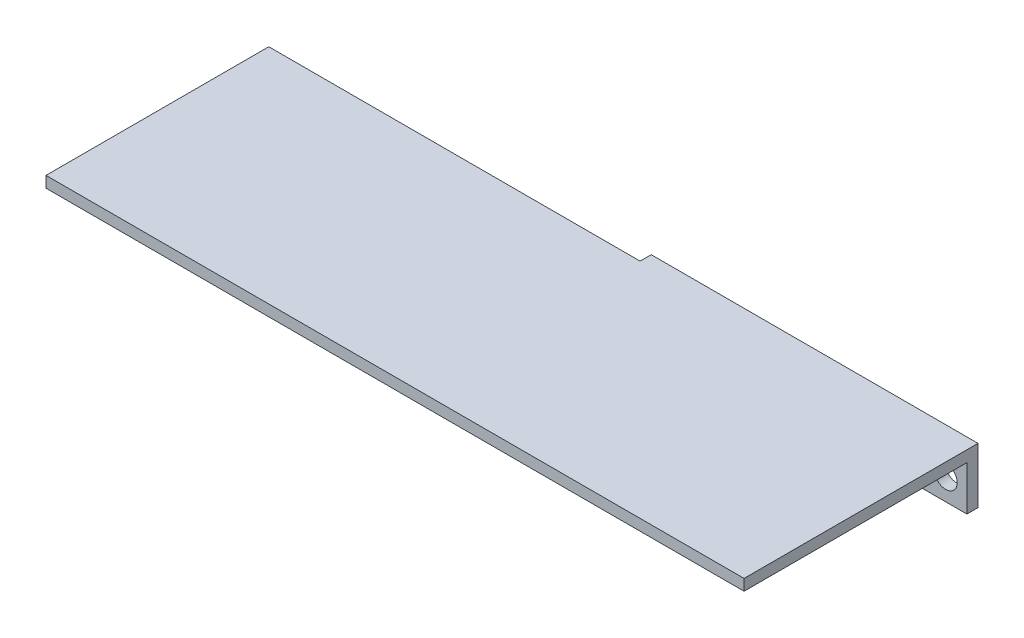
ISO-10303-21;
HEADER;
FILE_DESCRIPTION(('STEP AP214'),'2;1');
FILE_NAME('part.step','',(''),(''),'','','');
FILE_SCHEMA(('AUTOMOTIVE_DESIGN { 1 0 10303 214 1 1 1 1 }'));
ENDSEC;
DATA;
#1=APPLICATION_CONTEXT('core data for automotive mechanical design processes');
#2=APPLICATION_PROTOCOL_DEFINITION('international standard','automotive_design',2000,#1);
#3=PRODUCT_CONTEXT('',#1,'mechanical');
#4=PRODUCT('Part','Part','',(#3));
#5=PRODUCT_RELATED_PRODUCT_CATEGORY('part','',(#4));
#6=PRODUCT_DEFINITION_FORMATION('','',#4);
#7=PRODUCT_DEFINITION_CONTEXT('part definition',#1,'design');
#8=PRODUCT_DEFINITION('design','',#6,#7);
#9=PRODUCT_DEFINITION_SHAPE('','',#8);
#10=(LENGTH_UNIT() NAMED_UNIT(*) SI_UNIT(.MILLI.,.METRE.));
#11=(NAMED_UNIT(*) PLANE_ANGLE_UNIT() SI_UNIT($,.RADIAN.));
#12=(NAMED_UNIT(*) SI_UNIT($,.STERADIAN.) SOLID_ANGLE_UNIT());
#13=UNCERTAINTY_MEASURE_WITH_UNIT(LENGTH_MEASURE(1.E-05),#10,'distance_accuracy_value','');
#14=(GEOMETRIC_REPRESENTATION_CONTEXT(3) GLOBAL_UNCERTAINTY_ASSIGNED_CONTEXT((#13)) GLOBAL_UNIT_ASSIGNED_CONTEXT((#10,
#11,#12)) REPRESENTATION_CONTEXT('',''));
#15=CARTESIAN_POINT('',(0.,0.,0.));
#16=DIRECTION('',(0.,0.,1.));
#17=DIRECTION('',(1.,0.,0.));
#18=AXIS2_PLACEMENT_3D('',#15,#16,#17);
#19=CARTESIAN_POINT('',(-22.,-2.99999999999999,1.5));
#20=DIRECTION('',(1.,0.,0.));
#21=DIRECTION('',(0.,0.,-1.));
#22=AXIS2_PLACEMENT_3D('',#19,#20,#21);
#23=PLANE('',#22);
#24=DIRECTION('',(0.,-1.,0.));
#25=VECTOR('',#24,1.);
#26=CARTESIAN_POINT('',(-22.,4.5,1.5));
#27=LINE('',#26,#25);
#28=CARTESIAN_POINT('',(-22.,4.5,1.5));
#29=VERTEX_POINT('',#28);
#30=CARTESIAN_POINT('',(-22.,3.,1.5));
#31=VERTEX_POINT('',#30);
#32=EDGE_CURVE('E48',#29,#31,#27,.T.);
#33=ORIENTED_EDGE('',*,*,#32,.F.);
#34=DIRECTION('',(0.,0.,1.));
#35=VECTOR('',#34,1.);
#36=CARTESIAN_POINT('',(-22.,4.5,0.));
#37=LINE('',#36,#35);
#38=CARTESIAN_POINT('',(-22.,4.5,0.));
#39=VERTEX_POINT('',#38);
#40=EDGE_CURVE('E115',#39,#29,#37,.T.);
#41=ORIENTED_EDGE('',*,*,#40,.F.);
#42=DIRECTION('',(0.,-1.,0.));
#43=VECTOR('',#42,1.);
#44=CARTESIAN_POINT('',(-22.,-2.99999999999999,0.));
#45=LINE('',#44,#43);
#46=CARTESIAN_POINT('',(-22.,-2.99999999999999,0.));
#47=VERTEX_POINT('',#46);
#48=EDGE_CURVE('E78',#39,#47,#45,.T.);
#49=ORIENTED_EDGE('',*,*,#48,.T.);
#50=DIRECTION('',(0.,0.,-1.));
#51=VECTOR('',#50,1.);
#52=CARTESIAN_POINT('',(-22.,-2.99999999999999,1.5));
#53=LINE('',#52,#51);
#54=CARTESIAN_POINT('',(-22.,-2.99999999999999,1.5));
#55=VERTEX_POINT('',#54);
#56=EDGE_CURVE('E11',#55,#47,#53,.T.);
#57=ORIENTED_EDGE('',*,*,#56,.F.);
#58=DIRECTION('',(0.,-1.,0.));
#59=VECTOR('',#58,1.);
#60=CARTESIAN_POINT('',(-22.,-2.99999999999999,1.5));
#61=LINE('',#60,#59);
#62=EDGE_CURVE('E93',#31,#55,#61,.T.);
#63=ORIENTED_EDGE('',*,*,#62,.F.);
#64=EDGE_LOOP('',(#33,#41,#49,#57,#63));
#65=FACE_BOUND('',#64,.T.);
#66=ADVANCED_FACE('F34',(#65),#23,.F.);
#67=CARTESIAN_POINT('',(0.,0.,1.5));
#68=DIRECTION('',(0.,0.,1.));
#69=DIRECTION('',(1.,0.,0.));
#70=AXIS2_PLACEMENT_3D('',#67,#68,#69);
#71=PLANE('',#70);
#72=DIRECTION('',(1.,0.,0.));
#73=VECTOR('',#72,1.);
#74=CARTESIAN_POINT('',(0.,3.,1.5));
#75=LINE('',#74,#73);
#76=CARTESIAN_POINT('',(22.,3.,1.5));
#77=VERTEX_POINT('',#76);
#78=EDGE_CURVE('E117',#31,#77,#75,.T.);
#79=ORIENTED_EDGE('',*,*,#78,.F.);
#80=ORIENTED_EDGE('',*,*,#62,.T.);
#81=DIRECTION('',(1.,0.,0.));
#82=VECTOR('',#81,1.);
#83=CARTESIAN_POINT('',(22.,-3.,1.5));
#84=LINE('',#83,#82);
#85=CARTESIAN_POINT('',(22.,-3.,1.5));
#86=VERTEX_POINT('',#85);
#87=EDGE_CURVE('E57',#55,#86,#84,.T.);
#88=ORIENTED_EDGE('',*,*,#87,.T.);
#89=DIRECTION('',(0.,1.,0.));
#90=VECTOR('',#89,1.);
#91=CARTESIAN_POINT('',(22.,-3.,1.5));
#92=LINE('',#91,#90);
#93=EDGE_CURVE('E87',#86,#77,#92,.T.);
#94=ORIENTED_EDGE('',*,*,#93,.T.);
#95=EDGE_LOOP('',(#79,#80,#88,#94));
#96=FACE_BOUND('',#95,.T.);
#97=CARTESIAN_POINT('',(-19.14418972,0.,1.5));
#98=DIRECTION('',(0.,0.,1.));
#99=DIRECTION('',(1.,0.,0.));
#100=AXIS2_PLACEMENT_3D('',#97,#98,#99);
#101=CIRCLE('',#100,1.55);
#102=CARTESIAN_POINT('',(-17.59418972,0.,1.5));
#103=VERTEX_POINT('',#102);
#104=EDGE_CURVE('E98',#103,#103,#101,.T.);
#105=ORIENTED_EDGE('',*,*,#104,.F.);
#106=EDGE_LOOP('',(#105));
#107=FACE_BOUND('',#106,.T.);
#108=CARTESIAN_POINT('',(19.14418972,0.,1.5));
#109=DIRECTION('',(0.,0.,1.));
#110=DIRECTION('',(1.,0.,0.));
#111=AXIS2_PLACEMENT_3D('',#108,#109,#110);
#112=CIRCLE('',#111,1.55);
#113=CARTESIAN_POINT('',(20.69418972,0.,1.5));
#114=VERTEX_POINT('',#113);
#115=EDGE_CURVE('E104',#114,#114,#112,.T.);
#116=ORIENTED_EDGE('',*,*,#115,.F.);
#117=EDGE_LOOP('',(#116));
#118=FACE_BOUND('',#117,.T.);
#119=ADVANCED_FACE('F182',(#96,#107,#118),#71,.T.);
#120=CARTESIAN_POINT('',(0.,0.,0.));
#121=DIRECTION('',(0.,0.,1.));
#122=DIRECTION('',(1.,0.,0.));
#123=AXIS2_PLACEMENT_3D('',#120,#121,#122);
#124=PLANE('',#123);
#125=DIRECTION('',(1.,0.,0.));
#126=VECTOR('',#125,1.);
#127=CARTESIAN_POINT('',(22.,-3.,0.));
#128=LINE('',#127,#126);
#129=CARTESIAN_POINT('',(22.,-3.,0.));
#130=VERTEX_POINT('',#129);
#131=EDGE_CURVE('E69',#47,#130,#128,.T.);
#132=ORIENTED_EDGE('',*,*,#131,.F.);
#133=ORIENTED_EDGE('',*,*,#48,.F.);
#134=DIRECTION('',(-1.,0.,0.));
#135=VECTOR('',#134,1.);
#136=CARTESIAN_POINT('',(-22.,4.5,0.));
#137=LINE('',#136,#135);
#138=CARTESIAN_POINT('',(22.,4.5,0.));
#139=VERTEX_POINT('',#138);
#140=EDGE_CURVE('E92',#139,#39,#137,.T.);
#141=ORIENTED_EDGE('',*,*,#140,.F.);
#142=DIRECTION('',(0.,1.,0.));
#143=VECTOR('',#142,1.);
#144=CARTESIAN_POINT('',(22.,-3.,0.));
#145=LINE('',#144,#143);
#146=EDGE_CURVE('E77',#130,#139,#145,.T.);
#147=ORIENTED_EDGE('',*,*,#146,.F.);
#148=EDGE_LOOP('',(#132,#133,#141,#147));
#149=FACE_BOUND('',#148,.T.);
#150=CARTESIAN_POINT('',(-19.14418972,0.,0.));
#151=DIRECTION('',(0.,0.,1.));
#152=DIRECTION('',(1.,0.,0.));
#153=AXIS2_PLACEMENT_3D('',#150,#151,#152);
#154=CIRCLE('',#153,1.55);
#155=CARTESIAN_POINT('',(-17.59418972,0.,0.));
#156=VERTEX_POINT('',#155);
#157=EDGE_CURVE('E101',#156,#156,#154,.T.);
#158=ORIENTED_EDGE('',*,*,#157,.T.);
#159=EDGE_LOOP('',(#158));
#160=FACE_BOUND('',#159,.T.);
#161=CARTESIAN_POINT('',(19.14418972,0.,0.));
#162=DIRECTION('',(0.,0.,1.));
#163=DIRECTION('',(1.,0.,0.));
#164=AXIS2_PLACEMENT_3D('',#161,#162,#163);
#165=CIRCLE('',#164,1.55);
#166=CARTESIAN_POINT('',(20.69418972,0.,0.));
#167=VERTEX_POINT('',#166);
#168=EDGE_CURVE('E107',#167,#167,#165,.T.);
#169=ORIENTED_EDGE('',*,*,#168,.T.);
#170=EDGE_LOOP('',(#169));
#171=FACE_BOUND('',#170,.T.);
#172=ADVANCED_FACE('F89',(#149,#160,#171),#124,.F.);
#173=CARTESIAN_POINT('',(22.,-3.,1.5));
#174=DIRECTION('',(0.,1.,0.));
#175=DIRECTION('',(-1.,0.,0.));
#176=AXIS2_PLACEMENT_3D('',#173,#174,#175);
#177=PLANE('',#176);
#178=ORIENTED_EDGE('',*,*,#131,.T.);
#179=DIRECTION('',(0.,0.,-1.));
#180=VECTOR('',#179,1.);
#181=CARTESIAN_POINT('',(22.,-3.,1.5));
#182=LINE('',#181,#180);
#183=EDGE_CURVE('E41',#86,#130,#182,.T.);
#184=ORIENTED_EDGE('',*,*,#183,.F.);
#185=ORIENTED_EDGE('',*,*,#87,.F.);
#186=ORIENTED_EDGE('',*,*,#56,.T.);
#187=EDGE_LOOP('',(#178,#184,#185,#186));
#188=FACE_BOUND('',#187,.T.);
#189=ADVANCED_FACE('F71',(#188),#177,.F.);
#190=CARTESIAN_POINT('',(22.,-3.,1.5));
#191=DIRECTION('',(-1.,0.,0.));
#192=DIRECTION('',(0.,0.,1.));
#193=AXIS2_PLACEMENT_3D('',#190,#191,#192);
#194=PLANE('',#193);
#195=ORIENTED_EDGE('',*,*,#146,.T.);
#196=DIRECTION('',(0.,0.,-1.));
#197=VECTOR('',#196,1.);
#198=CARTESIAN_POINT('',(22.,4.5,0.));
#199=LINE('',#198,#197);
#200=CARTESIAN_POINT('',(22.,4.5,31.5));
#201=VERTEX_POINT('',#200);
#202=EDGE_CURVE('E113',#201,#139,#199,.T.);
#203=ORIENTED_EDGE('',*,*,#202,.F.);
#204=DIRECTION('',(0.,-1.,0.));
#205=VECTOR('',#204,1.);
#206=CARTESIAN_POINT('',(22.,4.5,31.5));
#207=LINE('',#206,#205);
#208=CARTESIAN_POINT('',(22.,3.,31.5));
#209=VERTEX_POINT('',#208);
#210=EDGE_CURVE('E128',#201,#209,#207,.T.);
#211=ORIENTED_EDGE('',*,*,#210,.T.);
#212=DIRECTION('',(0.,0.,-1.));
#213=VECTOR('',#212,1.);
#214=CARTESIAN_POINT('',(22.,3.,31.5));
#215=LINE('',#214,#213);
#216=EDGE_CURVE('E120',#209,#77,#215,.T.);
#217=ORIENTED_EDGE('',*,*,#216,.T.);
#218=ORIENTED_EDGE('',*,*,#93,.F.);
#219=ORIENTED_EDGE('',*,*,#183,.T.);
#220=EDGE_LOOP('',(#195,#203,#211,#217,#218,#219));
#221=FACE_BOUND('',#220,.T.);
#222=ADVANCED_FACE('F82',(#221),#194,.F.);
#223=CARTESIAN_POINT('',(-19.14418972,0.,1.5));
#224=DIRECTION('',(0.,0.,-1.));
#225=DIRECTION('',(-1.,0.,0.));
#226=AXIS2_PLACEMENT_3D('',#223,#224,#225);
#227=CYLINDRICAL_SURFACE('',#226,1.55);
#228=ORIENTED_EDGE('',*,*,#104,.T.);
#229=EDGE_LOOP('',(#228));
#230=FACE_BOUND('',#229,.T.);
#231=ORIENTED_EDGE('',*,*,#157,.F.);
#232=EDGE_LOOP('',(#231));
#233=FACE_BOUND('',#232,.T.);
#234=ADVANCED_FACE('F193',(#230,#233),#227,.F.);
#235=CARTESIAN_POINT('',(19.14418972,0.,1.5));
#236=DIRECTION('',(0.,0.,-1.));
#237=DIRECTION('',(-1.,0.,0.));
#238=AXIS2_PLACEMENT_3D('',#235,#236,#237);
#239=CYLINDRICAL_SURFACE('',#238,1.55);
#240=ORIENTED_EDGE('',*,*,#115,.T.);
#241=EDGE_LOOP('',(#240));
#242=FACE_BOUND('',#241,.T.);
#243=ORIENTED_EDGE('',*,*,#168,.F.);
#244=EDGE_LOOP('',(#243));
#245=FACE_BOUND('',#244,.T.);
#246=ADVANCED_FACE('F212',(#242,#245),#239,.F.);
#247=CARTESIAN_POINT('',(0.,4.5,0.));
#248=DIRECTION('',(0.,1.,0.));
#249=DIRECTION('',(-1.,0.,0.));
#250=AXIS2_PLACEMENT_3D('',#247,#248,#249);
#251=PLANE('',#250);
#252=ORIENTED_EDGE('',*,*,#40,.T.);
#253=DIRECTION('',(1.,0.,0.));
#254=VECTOR('',#253,1.);
#255=CARTESIAN_POINT('',(-72.,4.5,1.5));
#256=LINE('',#255,#254);
#257=CARTESIAN_POINT('',(-72.,4.5,1.5));
#258=VERTEX_POINT('',#257);
#259=EDGE_CURVE('E134',#258,#29,#256,.T.);
#260=ORIENTED_EDGE('',*,*,#259,.F.);
#261=DIRECTION('',(0.,0.,-1.));
#262=VECTOR('',#261,1.);
#263=CARTESIAN_POINT('',(-72.,4.5,1.5));
#264=LINE('',#263,#262);
#265=CARTESIAN_POINT('',(-72.,4.5,31.5));
#266=VERTEX_POINT('',#265);
#267=EDGE_CURVE('E137',#266,#258,#264,.T.);
#268=ORIENTED_EDGE('',*,*,#267,.F.);
#269=DIRECTION('',(-1.,0.,0.));
#270=VECTOR('',#269,1.);
#271=CARTESIAN_POINT('',(22.,4.5,31.5));
#272=LINE('',#271,#270);
#273=EDGE_CURVE('E122',#201,#266,#272,.T.);
#274=ORIENTED_EDGE('',*,*,#273,.F.);
#275=ORIENTED_EDGE('',*,*,#202,.T.);
#276=ORIENTED_EDGE('',*,*,#140,.T.);
#277=EDGE_LOOP('',(#252,#260,#268,#274,#275,#276));
#278=FACE_BOUND('',#277,.T.);
#279=ADVANCED_FACE('F179',(#278),#251,.T.);
#280=CARTESIAN_POINT('',(22.,3.,31.5));
#281=DIRECTION('',(0.,-1.,0.));
#282=DIRECTION('',(0.,0.,-1.));
#283=AXIS2_PLACEMENT_3D('',#280,#281,#282);
#284=PLANE('',#283);
#285=DIRECTION('',(-1.,0.,0.));
#286=VECTOR('',#285,1.);
#287=CARTESIAN_POINT('',(22.,3.,31.5));
#288=LINE('',#287,#286);
#289=CARTESIAN_POINT('',(-72.,3.,31.5));
#290=VERTEX_POINT('',#289);
#291=EDGE_CURVE('E125',#209,#290,#288,.T.);
#292=ORIENTED_EDGE('',*,*,#291,.T.);
#293=DIRECTION('',(0.,0.,1.));
#294=VECTOR('',#293,1.);
#295=CARTESIAN_POINT('',(-72.,3.,1.5));
#296=LINE('',#295,#294);
#297=CARTESIAN_POINT('',(-72.,3.,1.5));
#298=VERTEX_POINT('',#297);
#299=EDGE_CURVE('E145',#298,#290,#296,.T.);
#300=ORIENTED_EDGE('',*,*,#299,.F.);
#301=DIRECTION('',(1.,0.,0.));
#302=VECTOR('',#301,1.);
#303=CARTESIAN_POINT('',(-72.,3.,1.5));
#304=LINE('',#303,#302);
#305=EDGE_CURVE('E131',#298,#31,#304,.T.);
#306=ORIENTED_EDGE('',*,*,#305,.T.);
#307=ORIENTED_EDGE('',*,*,#78,.T.);
#308=ORIENTED_EDGE('',*,*,#216,.F.);
#309=EDGE_LOOP('',(#292,#300,#306,#307,#308));
#310=FACE_BOUND('',#309,.T.);
#311=ADVANCED_FACE('F165',(#310),#284,.T.);
#312=CARTESIAN_POINT('',(0.,0.,31.5));
#313=DIRECTION('',(0.,0.,-1.));
#314=DIRECTION('',(-1.,0.,0.));
#315=AXIS2_PLACEMENT_3D('',#312,#313,#314);
#316=PLANE('',#315);
#317=ORIENTED_EDGE('',*,*,#210,.F.);
#318=ORIENTED_EDGE('',*,*,#273,.T.);
#319=DIRECTION('',(0.,1.,0.));
#320=VECTOR('',#319,1.);
#321=CARTESIAN_POINT('',(-72.,4.5,31.5));
#322=LINE('',#321,#320);
#323=EDGE_CURVE('E142',#290,#266,#322,.T.);
#324=ORIENTED_EDGE('',*,*,#323,.F.);
#325=ORIENTED_EDGE('',*,*,#291,.F.);
#326=EDGE_LOOP('',(#317,#318,#324,#325));
#327=FACE_BOUND('',#326,.T.);
#328=ADVANCED_FACE('F231',(#327),#316,.F.);
#329=CARTESIAN_POINT('',(-72.,4.5,1.5));
#330=DIRECTION('',(0.,0.,1.));
#331=DIRECTION('',(1.,0.,0.));
#332=AXIS2_PLACEMENT_3D('',#329,#330,#331);
#333=PLANE('',#332);
#334=ORIENTED_EDGE('',*,*,#32,.T.);
#335=ORIENTED_EDGE('',*,*,#305,.F.);
#336=DIRECTION('',(0.,-1.,0.));
#337=VECTOR('',#336,1.);
#338=CARTESIAN_POINT('',(-72.,4.5,1.5));
#339=LINE('',#338,#337);
#340=EDGE_CURVE('E139',#258,#298,#339,.T.);
#341=ORIENTED_EDGE('',*,*,#340,.F.);
#342=ORIENTED_EDGE('',*,*,#259,.T.);
#343=EDGE_LOOP('',(#334,#335,#341,#342));
#344=FACE_BOUND('',#343,.T.);
#345=ADVANCED_FACE('F163',(#344),#333,.F.);
#346=CARTESIAN_POINT('',(-72.,0.,0.));
#347=DIRECTION('',(-1.,0.,0.));
#348=DIRECTION('',(0.,0.,1.));
#349=AXIS2_PLACEMENT_3D('',#346,#347,#348);
#350=PLANE('',#349);
#351=ORIENTED_EDGE('',*,*,#340,.T.);
#352=ORIENTED_EDGE('',*,*,#299,.T.);
#353=ORIENTED_EDGE('',*,*,#323,.T.);
#354=ORIENTED_EDGE('',*,*,#267,.T.);
#355=EDGE_LOOP('',(#351,#352,#353,#354));
#356=FACE_BOUND('',#355,.T.);
#357=ADVANCED_FACE('F153',(#356),#350,.T.);
#358=CLOSED_SHELL('',(#66,#119,#172,#189,#222,#234,#246,#279,#311,#328,#345,#357));
#359=MANIFOLD_SOLID_BREP('B2',#358);
#360=ADVANCED_BREP_SHAPE_REPRESENTATION('',(#18,#359),#14);
#361=SHAPE_DEFINITION_REPRESENTATION(#9,#360);
ENDSEC;
END-ISO-10303-21;
